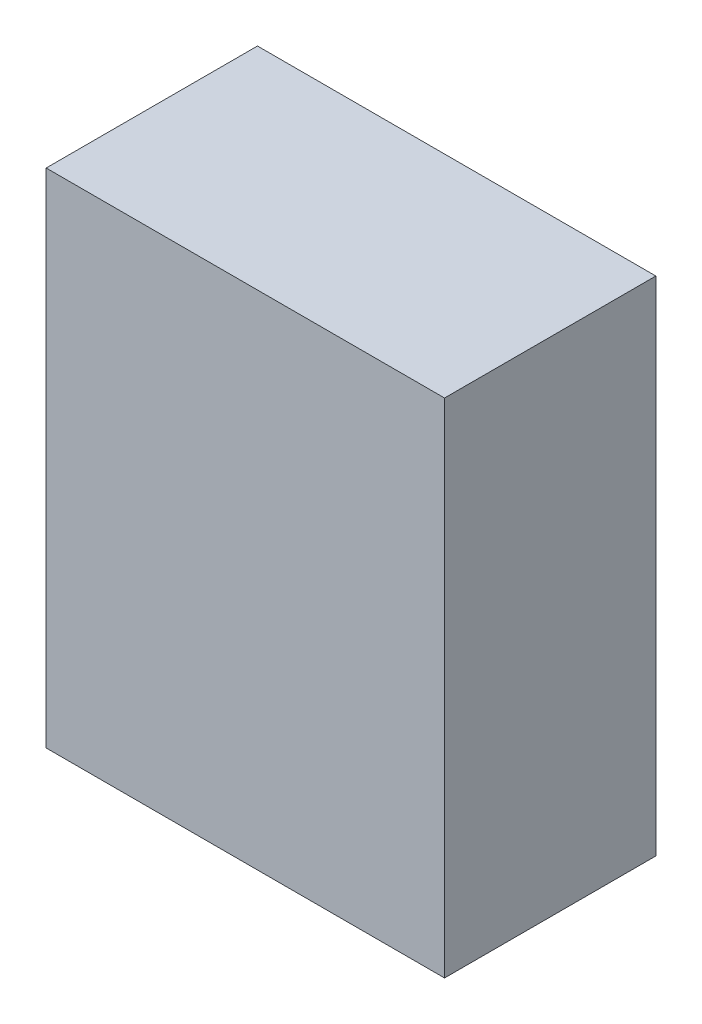
ISO-10303-21;
HEADER;
FILE_DESCRIPTION(('STEP AP214'),'2;1');
FILE_NAME('part.step','',(''),(''),'','','');
FILE_SCHEMA(('AUTOMOTIVE_DESIGN { 1 0 10303 214 1 1 1 1 }'));
ENDSEC;
DATA;
#1=APPLICATION_CONTEXT('core data for automotive mechanical design processes');
#2=APPLICATION_PROTOCOL_DEFINITION('international standard','automotive_design',2000,#1);
#3=PRODUCT_CONTEXT('',#1,'mechanical');
#4=PRODUCT('Part','Part','',(#3));
#5=PRODUCT_RELATED_PRODUCT_CATEGORY('part','',(#4));
#6=PRODUCT_DEFINITION_FORMATION('','',#4);
#7=PRODUCT_DEFINITION_CONTEXT('part definition',#1,'design');
#8=PRODUCT_DEFINITION('design','',#6,#7);
#9=PRODUCT_DEFINITION_SHAPE('','',#8);
#10=(LENGTH_UNIT() NAMED_UNIT(*) SI_UNIT(.MILLI.,.METRE.));
#11=(NAMED_UNIT(*) PLANE_ANGLE_UNIT() SI_UNIT($,.RADIAN.));
#12=(NAMED_UNIT(*) SI_UNIT($,.STERADIAN.) SOLID_ANGLE_UNIT());
#13=UNCERTAINTY_MEASURE_WITH_UNIT(LENGTH_MEASURE(1.E-05),#10,'distance_accuracy_value','');
#14=(GEOMETRIC_REPRESENTATION_CONTEXT(3) GLOBAL_UNCERTAINTY_ASSIGNED_CONTEXT((#13)) GLOBAL_UNIT_ASSIGNED_CONTEXT((#10,
#11,#12)) REPRESENTATION_CONTEXT('',''));
#15=CARTESIAN_POINT('',(0.,0.,0.));
#16=DIRECTION('',(0.,0.,1.));
#17=DIRECTION('',(1.,0.,0.));
#18=AXIS2_PLACEMENT_3D('',#15,#16,#17);
#19=CARTESIAN_POINT('',(-8.72767857142856,29.,-6.41741071428571));
#20=DIRECTION('',(1.,0.,0.));
#21=DIRECTION('',(0.,0.,-1.));
#22=AXIS2_PLACEMENT_3D('',#19,#20,#21);
#23=PLANE('',#22);
#24=DIRECTION('',(0.,0.,1.));
#25=VECTOR('',#24,1.);
#26=CARTESIAN_POINT('',(-8.72767857142856,0.,-6.41741071428571));
#27=LINE('',#26,#25);
#28=CARTESIAN_POINT('',(-8.72767857142856,0.,-6.41741071428571));
#29=VERTEX_POINT('',#28);
#30=CARTESIAN_POINT('',(-8.72767857142856,0.,5.78258928571429));
#31=VERTEX_POINT('',#30);
#32=EDGE_CURVE('E107',#29,#31,#27,.T.);
#33=ORIENTED_EDGE('',*,*,#32,.T.);
#34=DIRECTION('',(0.,-1.,0.));
#35=VECTOR('',#34,1.);
#36=CARTESIAN_POINT('',(-8.72767857142856,29.,5.78258928571429));
#37=LINE('',#36,#35);
#38=CARTESIAN_POINT('',(-8.72767857142856,29.,5.78258928571429));
#39=VERTEX_POINT('',#38);
#40=EDGE_CURVE('E11',#39,#31,#37,.T.);
#41=ORIENTED_EDGE('',*,*,#40,.F.);
#42=DIRECTION('',(0.,0.,1.));
#43=VECTOR('',#42,1.);
#44=CARTESIAN_POINT('',(-8.72767857142856,29.,-6.41741071428571));
#45=LINE('',#44,#43);
#46=CARTESIAN_POINT('',(-8.72767857142856,29.,-6.41741071428571));
#47=VERTEX_POINT('',#46);
#48=EDGE_CURVE('E91',#47,#39,#45,.T.);
#49=ORIENTED_EDGE('',*,*,#48,.F.);
#50=DIRECTION('',(0.,-1.,0.));
#51=VECTOR('',#50,1.);
#52=CARTESIAN_POINT('',(-8.72767857142856,29.,-6.41741071428571));
#53=LINE('',#52,#51);
#54=EDGE_CURVE('E103',#47,#29,#53,.T.);
#55=ORIENTED_EDGE('',*,*,#54,.T.);
#56=EDGE_LOOP('',(#33,#41,#49,#55));
#57=FACE_BOUND('',#56,.T.);
#58=ADVANCED_FACE('F39',(#57),#23,.F.);
#59=CARTESIAN_POINT('',(-8.72767857142856,29.,5.78258928571429));
#60=DIRECTION('',(0.,0.,-1.));
#61=DIRECTION('',(-1.,0.,0.));
#62=AXIS2_PLACEMENT_3D('',#59,#60,#61);
#63=PLANE('',#62);
#64=DIRECTION('',(1.,0.,0.));
#65=VECTOR('',#64,1.);
#66=CARTESIAN_POINT('',(-8.72767857142856,0.,5.78258928571429));
#67=LINE('',#66,#65);
#68=CARTESIAN_POINT('',(14.2723214285714,0.,5.78258928571429));
#69=VERTEX_POINT('',#68);
#70=EDGE_CURVE('E96',#31,#69,#67,.T.);
#71=ORIENTED_EDGE('',*,*,#70,.T.);
#72=DIRECTION('',(0.,-1.,0.));
#73=VECTOR('',#72,1.);
#74=CARTESIAN_POINT('',(14.2723214285714,29.,5.78258928571429));
#75=LINE('',#74,#73);
#76=CARTESIAN_POINT('',(14.2723214285714,29.,5.78258928571429));
#77=VERTEX_POINT('',#76);
#78=EDGE_CURVE('E48',#77,#69,#75,.T.);
#79=ORIENTED_EDGE('',*,*,#78,.F.);
#80=DIRECTION('',(1.,0.,0.));
#81=VECTOR('',#80,1.);
#82=CARTESIAN_POINT('',(-8.72767857142856,29.,5.78258928571429));
#83=LINE('',#82,#81);
#84=EDGE_CURVE('E86',#39,#77,#83,.T.);
#85=ORIENTED_EDGE('',*,*,#84,.F.);
#86=ORIENTED_EDGE('',*,*,#40,.T.);
#87=EDGE_LOOP('',(#71,#79,#85,#86));
#88=FACE_BOUND('',#87,.T.);
#89=ADVANCED_FACE('F95',(#88),#63,.F.);
#90=CARTESIAN_POINT('',(14.2723214285714,29.,-6.41741071428571));
#91=DIRECTION('',(-1.,0.,0.));
#92=DIRECTION('',(0.,0.,1.));
#93=AXIS2_PLACEMENT_3D('',#90,#91,#92);
#94=PLANE('',#93);
#95=DIRECTION('',(0.,0.,-1.));
#96=VECTOR('',#95,1.);
#97=CARTESIAN_POINT('',(14.2723214285714,0.,-6.41741071428571));
#98=LINE('',#97,#96);
#99=CARTESIAN_POINT('',(14.2723214285714,0.,-6.41741071428571));
#100=VERTEX_POINT('',#99);
#101=EDGE_CURVE('E73',#69,#100,#98,.T.);
#102=ORIENTED_EDGE('',*,*,#101,.T.);
#103=DIRECTION('',(0.,-1.,0.));
#104=VECTOR('',#103,1.);
#105=CARTESIAN_POINT('',(14.2723214285714,29.,-6.41741071428571));
#106=LINE('',#105,#104);
#107=CARTESIAN_POINT('',(14.2723214285714,29.,-6.41741071428571));
#108=VERTEX_POINT('',#107);
#109=EDGE_CURVE('E98',#108,#100,#106,.T.);
#110=ORIENTED_EDGE('',*,*,#109,.F.);
#111=DIRECTION('',(0.,0.,-1.));
#112=VECTOR('',#111,1.);
#113=CARTESIAN_POINT('',(14.2723214285714,29.,-6.41741071428571));
#114=LINE('',#113,#112);
#115=EDGE_CURVE('E89',#77,#108,#114,.T.);
#116=ORIENTED_EDGE('',*,*,#115,.F.);
#117=ORIENTED_EDGE('',*,*,#78,.T.);
#118=EDGE_LOOP('',(#102,#110,#116,#117));
#119=FACE_BOUND('',#118,.T.);
#120=ADVANCED_FACE('F99',(#119),#94,.F.);
#121=CARTESIAN_POINT('',(-8.72767857142856,29.,-6.41741071428571));
#122=DIRECTION('',(0.,0.,1.));
#123=DIRECTION('',(1.,0.,0.));
#124=AXIS2_PLACEMENT_3D('',#121,#122,#123);
#125=PLANE('',#124);
#126=DIRECTION('',(-1.,0.,0.));
#127=VECTOR('',#126,1.);
#128=CARTESIAN_POINT('',(-8.72767857142856,0.,-6.41741071428571));
#129=LINE('',#128,#127);
#130=EDGE_CURVE('E79',#100,#29,#129,.T.);
#131=ORIENTED_EDGE('',*,*,#130,.T.);
#132=ORIENTED_EDGE('',*,*,#54,.F.);
#133=DIRECTION('',(-1.,0.,0.));
#134=VECTOR('',#133,1.);
#135=CARTESIAN_POINT('',(-8.72767857142856,29.,-6.41741071428571));
#136=LINE('',#135,#134);
#137=EDGE_CURVE('E56',#108,#47,#136,.T.);
#138=ORIENTED_EDGE('',*,*,#137,.F.);
#139=ORIENTED_EDGE('',*,*,#109,.T.);
#140=EDGE_LOOP('',(#131,#132,#138,#139));
#141=FACE_BOUND('',#140,.T.);
#142=ADVANCED_FACE('F120',(#141),#125,.F.);
#143=CARTESIAN_POINT('',(0.,29.,0.));
#144=DIRECTION('',(0.,1.,0.));
#145=DIRECTION('',(0.,0.,1.));
#146=AXIS2_PLACEMENT_3D('',#143,#144,#145);
#147=PLANE('',#146);
#148=ORIENTED_EDGE('',*,*,#48,.T.);
#149=ORIENTED_EDGE('',*,*,#84,.T.);
#150=ORIENTED_EDGE('',*,*,#115,.T.);
#151=ORIENTED_EDGE('',*,*,#137,.T.);
#152=EDGE_LOOP('',(#148,#149,#150,#151));
#153=FACE_BOUND('',#152,.T.);
#154=ADVANCED_FACE('F87',(#153),#147,.T.);
#155=CARTESIAN_POINT('',(0.,0.,0.));
#156=DIRECTION('',(0.,1.,0.));
#157=DIRECTION('',(0.,0.,1.));
#158=AXIS2_PLACEMENT_3D('',#155,#156,#157);
#159=PLANE('',#158);
#160=ORIENTED_EDGE('',*,*,#32,.F.);
#161=ORIENTED_EDGE('',*,*,#130,.F.);
#162=ORIENTED_EDGE('',*,*,#101,.F.);
#163=ORIENTED_EDGE('',*,*,#70,.F.);
#164=EDGE_LOOP('',(#160,#161,#162,#163));
#165=FACE_BOUND('',#164,.T.);
#166=ADVANCED_FACE('F123',(#165),#159,.F.);
#167=CLOSED_SHELL('',(#58,#89,#120,#142,#154,#166));
#168=MANIFOLD_SOLID_BREP('B2',#167);
#169=ADVANCED_BREP_SHAPE_REPRESENTATION('',(#18,#168),#14);
#170=SHAPE_DEFINITION_REPRESENTATION(#9,#169);
ENDSEC;
END-ISO-10303-21;
